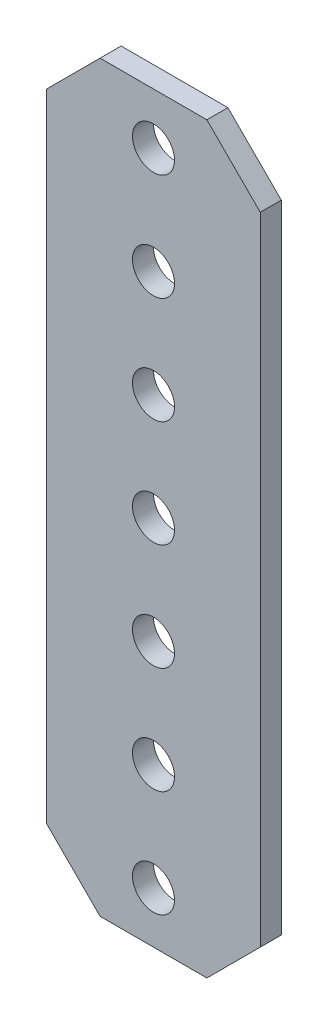
ISO-10303-21;
HEADER;
FILE_DESCRIPTION(('STEP AP214'),'2;1');
FILE_NAME('part.step','',(''),(''),'','','');
FILE_SCHEMA(('AUTOMOTIVE_DESIGN { 1 0 10303 214 1 1 1 1 }'));
ENDSEC;
DATA;
#1=APPLICATION_CONTEXT('core data for automotive mechanical design processes');
#2=APPLICATION_PROTOCOL_DEFINITION('international standard','automotive_design',2000,#1);
#3=PRODUCT_CONTEXT('',#1,'mechanical');
#4=PRODUCT('Part','Part','',(#3));
#5=PRODUCT_RELATED_PRODUCT_CATEGORY('part','',(#4));
#6=PRODUCT_DEFINITION_FORMATION('','',#4);
#7=PRODUCT_DEFINITION_CONTEXT('part definition',#1,'design');
#8=PRODUCT_DEFINITION('design','',#6,#7);
#9=PRODUCT_DEFINITION_SHAPE('','',#8);
#10=(LENGTH_UNIT() NAMED_UNIT(*) SI_UNIT(.MILLI.,.METRE.));
#11=(NAMED_UNIT(*) PLANE_ANGLE_UNIT() SI_UNIT($,.RADIAN.));
#12=(NAMED_UNIT(*) SI_UNIT($,.STERADIAN.) SOLID_ANGLE_UNIT());
#13=UNCERTAINTY_MEASURE_WITH_UNIT(LENGTH_MEASURE(1.E-05),#10,'distance_accuracy_value','');
#14=(GEOMETRIC_REPRESENTATION_CONTEXT(3) GLOBAL_UNCERTAINTY_ASSIGNED_CONTEXT((#13)) GLOBAL_UNIT_ASSIGNED_CONTEXT((#10,
#11,#12)) REPRESENTATION_CONTEXT('',''));
#15=CARTESIAN_POINT('',(0.,0.,0.));
#16=DIRECTION('',(0.,0.,1.));
#17=DIRECTION('',(1.,0.,0.));
#18=AXIS2_PLACEMENT_3D('',#15,#16,#17);
#19=CARTESIAN_POINT('',(-6.34999999999999,44.196,-1.25));
#20=DIRECTION('',(-0.707106781186547,0.707106781186548,0.));
#21=DIRECTION('',(-0.707106781186548,-0.707106781186547,0.));
#22=AXIS2_PLACEMENT_3D('',#19,#20,#21);
#23=PLANE('',#22);
#24=DIRECTION('',(-0.707106781186549,-0.707106781186547,0.));
#25=VECTOR('',#24,1.);
#26=CARTESIAN_POINT('',(-6.34999999999999,44.196,1.25));
#27=LINE('',#26,#25);
#28=CARTESIAN_POINT('',(-6.34999999999999,44.196,1.25));
#29=VERTEX_POINT('',#28);
#30=CARTESIAN_POINT('',(-12.7,37.846,1.25));
#31=VERTEX_POINT('',#30);
#32=EDGE_CURVE('E136',#29,#31,#27,.T.);
#33=ORIENTED_EDGE('',*,*,#32,.F.);
#34=DIRECTION('',(0.,0.,1.));
#35=VECTOR('',#34,1.);
#36=CARTESIAN_POINT('',(-6.34999999999999,44.196,-1.25));
#37=LINE('',#36,#35);
#38=CARTESIAN_POINT('',(-6.34999999999999,44.196,-1.25));
#39=VERTEX_POINT('',#38);
#40=EDGE_CURVE('E11',#39,#29,#37,.T.);
#41=ORIENTED_EDGE('',*,*,#40,.F.);
#42=DIRECTION('',(-0.707106781186549,-0.707106781186547,0.));
#43=VECTOR('',#42,1.);
#44=CARTESIAN_POINT('',(-6.34999999999999,44.196,-1.25));
#45=LINE('',#44,#43);
#46=CARTESIAN_POINT('',(-12.7,37.846,-1.25));
#47=VERTEX_POINT('',#46);
#48=EDGE_CURVE('E157',#39,#47,#45,.T.);
#49=ORIENTED_EDGE('',*,*,#48,.T.);
#50=DIRECTION('',(0.,0.,1.));
#51=VECTOR('',#50,1.);
#52=CARTESIAN_POINT('',(-12.7,37.846,-1.25));
#53=LINE('',#52,#51);
#54=EDGE_CURVE('E42',#47,#31,#53,.T.);
#55=ORIENTED_EDGE('',*,*,#54,.T.);
#56=EDGE_LOOP('',(#33,#41,#49,#55));
#57=FACE_BOUND('',#56,.T.);
#58=ADVANCED_FACE('F39',(#57),#23,.T.);
#59=CARTESIAN_POINT('',(6.35000000000001,44.196,-1.25));
#60=DIRECTION('',(0.,1.,0.));
#61=DIRECTION('',(-1.,0.,0.));
#62=AXIS2_PLACEMENT_3D('',#59,#60,#61);
#63=PLANE('',#62);
#64=DIRECTION('',(-1.,0.,0.));
#65=VECTOR('',#64,1.);
#66=CARTESIAN_POINT('',(6.35000000000001,44.196,1.25));
#67=LINE('',#66,#65);
#68=CARTESIAN_POINT('',(6.35000000000001,44.196,1.25));
#69=VERTEX_POINT('',#68);
#70=EDGE_CURVE('E155',#69,#29,#67,.T.);
#71=ORIENTED_EDGE('',*,*,#70,.F.);
#72=DIRECTION('',(0.,0.,1.));
#73=VECTOR('',#72,1.);
#74=CARTESIAN_POINT('',(6.35000000000001,44.196,-1.25));
#75=LINE('',#74,#73);
#76=CARTESIAN_POINT('',(6.35000000000001,44.196,-1.25));
#77=VERTEX_POINT('',#76);
#78=EDGE_CURVE('E48',#77,#69,#75,.T.);
#79=ORIENTED_EDGE('',*,*,#78,.F.);
#80=DIRECTION('',(-1.,0.,0.));
#81=VECTOR('',#80,1.);
#82=CARTESIAN_POINT('',(6.35000000000001,44.196,-1.25));
#83=LINE('',#82,#81);
#84=EDGE_CURVE('E126',#77,#39,#83,.T.);
#85=ORIENTED_EDGE('',*,*,#84,.T.);
#86=ORIENTED_EDGE('',*,*,#40,.T.);
#87=EDGE_LOOP('',(#71,#79,#85,#86));
#88=FACE_BOUND('',#87,.T.);
#89=ADVANCED_FACE('F169',(#88),#63,.T.);
#90=CARTESIAN_POINT('',(12.7,37.846,-1.25));
#91=DIRECTION('',(0.707106781186548,0.707106781186548,0.));
#92=DIRECTION('',(-0.707106781186548,0.707106781186548,0.));
#93=AXIS2_PLACEMENT_3D('',#90,#91,#92);
#94=PLANE('',#93);
#95=DIRECTION('',(-0.707106781186547,0.707106781186547,0.));
#96=VECTOR('',#95,1.);
#97=CARTESIAN_POINT('',(12.7,37.846,1.25));
#98=LINE('',#97,#96);
#99=CARTESIAN_POINT('',(12.7,37.846,1.25));
#100=VERTEX_POINT('',#99);
#101=EDGE_CURVE('E113',#100,#69,#98,.T.);
#102=ORIENTED_EDGE('',*,*,#101,.F.);
#103=DIRECTION('',(0.,0.,1.));
#104=VECTOR('',#103,1.);
#105=CARTESIAN_POINT('',(12.7,37.846,-1.25));
#106=LINE('',#105,#104);
#107=CARTESIAN_POINT('',(12.7,37.846,-1.25));
#108=VERTEX_POINT('',#107);
#109=EDGE_CURVE('E108',#108,#100,#106,.T.);
#110=ORIENTED_EDGE('',*,*,#109,.F.);
#111=DIRECTION('',(-0.707106781186547,0.707106781186547,0.));
#112=VECTOR('',#111,1.);
#113=CARTESIAN_POINT('',(12.7,37.846,-1.25));
#114=LINE('',#113,#112);
#115=EDGE_CURVE('E111',#108,#77,#114,.T.);
#116=ORIENTED_EDGE('',*,*,#115,.T.);
#117=ORIENTED_EDGE('',*,*,#78,.T.);
#118=EDGE_LOOP('',(#102,#110,#116,#117));
#119=FACE_BOUND('',#118,.T.);
#120=ADVANCED_FACE('F110',(#119),#94,.T.);
#121=CARTESIAN_POINT('',(12.7,-37.846,-1.25));
#122=DIRECTION('',(1.,0.,0.));
#123=DIRECTION('',(0.,0.,-1.));
#124=AXIS2_PLACEMENT_3D('',#121,#122,#123);
#125=PLANE('',#124);
#126=DIRECTION('',(0.,1.,0.));
#127=VECTOR('',#126,1.);
#128=CARTESIAN_POINT('',(12.7,-37.846,1.25));
#129=LINE('',#128,#127);
#130=CARTESIAN_POINT('',(12.7,-37.846,1.25));
#131=VERTEX_POINT('',#130);
#132=EDGE_CURVE('E152',#131,#100,#129,.T.);
#133=ORIENTED_EDGE('',*,*,#132,.F.);
#134=DIRECTION('',(0.,0.,1.));
#135=VECTOR('',#134,1.);
#136=CARTESIAN_POINT('',(12.7,-37.846,-1.25));
#137=LINE('',#136,#135);
#138=CARTESIAN_POINT('',(12.7,-37.846,-1.25));
#139=VERTEX_POINT('',#138);
#140=EDGE_CURVE('E118',#139,#131,#137,.T.);
#141=ORIENTED_EDGE('',*,*,#140,.F.);
#142=DIRECTION('',(0.,1.,0.));
#143=VECTOR('',#142,1.);
#144=CARTESIAN_POINT('',(12.7,-37.846,-1.25));
#145=LINE('',#144,#143);
#146=EDGE_CURVE('E124',#139,#108,#145,.T.);
#147=ORIENTED_EDGE('',*,*,#146,.T.);
#148=ORIENTED_EDGE('',*,*,#109,.T.);
#149=EDGE_LOOP('',(#133,#141,#147,#148));
#150=FACE_BOUND('',#149,.T.);
#151=ADVANCED_FACE('F128',(#150),#125,.T.);
#152=CARTESIAN_POINT('',(6.35000000000001,-44.196,-1.25));
#153=DIRECTION('',(0.707106781186547,-0.707106781186548,0.));
#154=DIRECTION('',(0.707106781186548,0.707106781186547,0.));
#155=AXIS2_PLACEMENT_3D('',#152,#153,#154);
#156=PLANE('',#155);
#157=DIRECTION('',(0.707106781186548,0.707106781186547,0.));
#158=VECTOR('',#157,1.);
#159=CARTESIAN_POINT('',(6.35000000000001,-44.196,1.25));
#160=LINE('',#159,#158);
#161=CARTESIAN_POINT('',(6.35000000000001,-44.196,1.25));
#162=VERTEX_POINT('',#161);
#163=EDGE_CURVE('E149',#162,#131,#160,.T.);
#164=ORIENTED_EDGE('',*,*,#163,.F.);
#165=DIRECTION('',(0.,0.,1.));
#166=VECTOR('',#165,1.);
#167=CARTESIAN_POINT('',(6.35000000000001,-44.196,-1.25));
#168=LINE('',#167,#166);
#169=CARTESIAN_POINT('',(6.35000000000001,-44.196,-1.25));
#170=VERTEX_POINT('',#169);
#171=EDGE_CURVE('E161',#170,#162,#168,.T.);
#172=ORIENTED_EDGE('',*,*,#171,.F.);
#173=DIRECTION('',(0.707106781186548,0.707106781186547,0.));
#174=VECTOR('',#173,1.);
#175=CARTESIAN_POINT('',(6.35000000000001,-44.196,-1.25));
#176=LINE('',#175,#174);
#177=EDGE_CURVE('E129',#170,#139,#176,.T.);
#178=ORIENTED_EDGE('',*,*,#177,.T.);
#179=ORIENTED_EDGE('',*,*,#140,.T.);
#180=EDGE_LOOP('',(#164,#172,#178,#179));
#181=FACE_BOUND('',#180,.T.);
#182=ADVANCED_FACE('F182',(#181),#156,.T.);
#183=CARTESIAN_POINT('',(-6.34999999999999,-44.196,-1.25));
#184=DIRECTION('',(0.,-1.,0.));
#185=DIRECTION('',(0.,0.,-1.));
#186=AXIS2_PLACEMENT_3D('',#183,#184,#185);
#187=PLANE('',#186);
#188=DIRECTION('',(1.,0.,0.));
#189=VECTOR('',#188,1.);
#190=CARTESIAN_POINT('',(-6.34999999999999,-44.196,1.25));
#191=LINE('',#190,#189);
#192=CARTESIAN_POINT('',(-6.34999999999999,-44.196,1.25));
#193=VERTEX_POINT('',#192);
#194=EDGE_CURVE('E146',#193,#162,#191,.T.);
#195=ORIENTED_EDGE('',*,*,#194,.F.);
#196=DIRECTION('',(0.,0.,1.));
#197=VECTOR('',#196,1.);
#198=CARTESIAN_POINT('',(-6.34999999999999,-44.196,-1.25));
#199=LINE('',#198,#197);
#200=CARTESIAN_POINT('',(-6.34999999999999,-44.196,-1.25));
#201=VERTEX_POINT('',#200);
#202=EDGE_CURVE('E163',#201,#193,#199,.T.);
#203=ORIENTED_EDGE('',*,*,#202,.F.);
#204=DIRECTION('',(1.,0.,0.));
#205=VECTOR('',#204,1.);
#206=CARTESIAN_POINT('',(-6.34999999999999,-44.196,-1.25));
#207=LINE('',#206,#205);
#208=EDGE_CURVE('E131',#201,#170,#207,.T.);
#209=ORIENTED_EDGE('',*,*,#208,.T.);
#210=ORIENTED_EDGE('',*,*,#171,.T.);
#211=EDGE_LOOP('',(#195,#203,#209,#210));
#212=FACE_BOUND('',#211,.T.);
#213=ADVANCED_FACE('F185',(#212),#187,.T.);
#214=CARTESIAN_POINT('',(-12.7,-37.846,-1.25));
#215=DIRECTION('',(-0.707106781186547,-0.707106781186548,0.));
#216=DIRECTION('',(0.707106781186548,-0.707106781186547,0.));
#217=AXIS2_PLACEMENT_3D('',#214,#215,#216);
#218=PLANE('',#217);
#219=DIRECTION('',(0.707106781186548,-0.707106781186547,0.));
#220=VECTOR('',#219,1.);
#221=CARTESIAN_POINT('',(-12.7,-37.846,1.25));
#222=LINE('',#221,#220);
#223=CARTESIAN_POINT('',(-12.7,-37.846,1.25));
#224=VERTEX_POINT('',#223);
#225=EDGE_CURVE('E143',#224,#193,#222,.T.);
#226=ORIENTED_EDGE('',*,*,#225,.F.);
#227=DIRECTION('',(0.,0.,1.));
#228=VECTOR('',#227,1.);
#229=CARTESIAN_POINT('',(-12.7,-37.846,-1.25));
#230=LINE('',#229,#228);
#231=CARTESIAN_POINT('',(-12.7,-37.846,-1.25));
#232=VERTEX_POINT('',#231);
#233=EDGE_CURVE('E164',#232,#224,#230,.T.);
#234=ORIENTED_EDGE('',*,*,#233,.F.);
#235=DIRECTION('',(0.707106781186548,-0.707106781186547,0.));
#236=VECTOR('',#235,1.);
#237=CARTESIAN_POINT('',(-12.7,-37.846,-1.25));
#238=LINE('',#237,#236);
#239=EDGE_CURVE('E281',#232,#201,#238,.T.);
#240=ORIENTED_EDGE('',*,*,#239,.T.);
#241=ORIENTED_EDGE('',*,*,#202,.T.);
#242=EDGE_LOOP('',(#226,#234,#240,#241));
#243=FACE_BOUND('',#242,.T.);
#244=ADVANCED_FACE('F189',(#243),#218,.T.);
#245=CARTESIAN_POINT('',(-12.7,37.846,-1.25));
#246=DIRECTION('',(-1.,0.,0.));
#247=DIRECTION('',(0.,-1.,0.));
#248=AXIS2_PLACEMENT_3D('',#245,#246,#247);
#249=PLANE('',#248);
#250=DIRECTION('',(0.,-1.,0.));
#251=VECTOR('',#250,1.);
#252=CARTESIAN_POINT('',(-12.7,37.846,1.25));
#253=LINE('',#252,#251);
#254=EDGE_CURVE('E139',#31,#224,#253,.T.);
#255=ORIENTED_EDGE('',*,*,#254,.F.);
#256=ORIENTED_EDGE('',*,*,#54,.F.);
#257=DIRECTION('',(0.,-1.,0.));
#258=VECTOR('',#257,1.);
#259=CARTESIAN_POINT('',(-12.7,37.846,-1.25));
#260=LINE('',#259,#258);
#261=EDGE_CURVE('E279',#47,#232,#260,.T.);
#262=ORIENTED_EDGE('',*,*,#261,.T.);
#263=ORIENTED_EDGE('',*,*,#233,.T.);
#264=EDGE_LOOP('',(#255,#256,#262,#263));
#265=FACE_BOUND('',#264,.T.);
#266=ADVANCED_FACE('F166',(#265),#249,.T.);
#267=CARTESIAN_POINT('',(0.,0.,-1.25));
#268=DIRECTION('',(0.,0.,1.));
#269=DIRECTION('',(1.,0.,0.));
#270=AXIS2_PLACEMENT_3D('',#267,#268,#269);
#271=PLANE('',#270);
#272=CARTESIAN_POINT('',(0.,25.4,-1.25));
#273=DIRECTION('',(0.,0.,1.));
#274=DIRECTION('',(-1.,0.,0.));
#275=AXIS2_PLACEMENT_3D('',#272,#273,#274);
#276=CIRCLE('',#275,2.5);
#277=CARTESIAN_POINT('',(-2.5,25.4,-1.25));
#278=VERTEX_POINT('',#277);
#279=EDGE_CURVE('E236',#278,#278,#276,.T.);
#280=ORIENTED_EDGE('',*,*,#279,.T.);
#281=EDGE_LOOP('',(#280));
#282=FACE_BOUND('',#281,.T.);
#283=CARTESIAN_POINT('',(0.,38.1,-1.25));
#284=DIRECTION('',(0.,0.,1.));
#285=DIRECTION('',(-1.,0.,0.));
#286=AXIS2_PLACEMENT_3D('',#283,#284,#285);
#287=CIRCLE('',#286,2.5);
#288=CARTESIAN_POINT('',(-2.5,38.1,-1.25));
#289=VERTEX_POINT('',#288);
#290=EDGE_CURVE('E244',#289,#289,#287,.T.);
#291=ORIENTED_EDGE('',*,*,#290,.T.);
#292=EDGE_LOOP('',(#291));
#293=FACE_BOUND('',#292,.T.);
#294=CARTESIAN_POINT('',(0.,12.7,-1.25));
#295=DIRECTION('',(0.,0.,1.));
#296=DIRECTION('',(-1.,0.,0.));
#297=AXIS2_PLACEMENT_3D('',#294,#295,#296);
#298=CIRCLE('',#297,2.5);
#299=CARTESIAN_POINT('',(-2.5,12.7,-1.25));
#300=VERTEX_POINT('',#299);
#301=EDGE_CURVE('E250',#300,#300,#298,.T.);
#302=ORIENTED_EDGE('',*,*,#301,.T.);
#303=EDGE_LOOP('',(#302));
#304=FACE_BOUND('',#303,.T.);
#305=CARTESIAN_POINT('',(0.,0.,-1.25));
#306=DIRECTION('',(0.,0.,1.));
#307=DIRECTION('',(-1.,0.,0.));
#308=AXIS2_PLACEMENT_3D('',#305,#306,#307);
#309=CIRCLE('',#308,2.5);
#310=CARTESIAN_POINT('',(-2.5,0.,-1.25));
#311=VERTEX_POINT('',#310);
#312=EDGE_CURVE('E256',#311,#311,#309,.T.);
#313=ORIENTED_EDGE('',*,*,#312,.T.);
#314=EDGE_LOOP('',(#313));
#315=FACE_BOUND('',#314,.T.);
#316=CARTESIAN_POINT('',(0.,-12.7,-1.25));
#317=DIRECTION('',(0.,0.,1.));
#318=DIRECTION('',(-1.,0.,0.));
#319=AXIS2_PLACEMENT_3D('',#316,#317,#318);
#320=CIRCLE('',#319,2.5);
#321=CARTESIAN_POINT('',(-2.5,-12.7,-1.25));
#322=VERTEX_POINT('',#321);
#323=EDGE_CURVE('E262',#322,#322,#320,.T.);
#324=ORIENTED_EDGE('',*,*,#323,.T.);
#325=EDGE_LOOP('',(#324));
#326=FACE_BOUND('',#325,.T.);
#327=CARTESIAN_POINT('',(0.,-25.4,-1.25));
#328=DIRECTION('',(0.,0.,1.));
#329=DIRECTION('',(-1.,0.,0.));
#330=AXIS2_PLACEMENT_3D('',#327,#328,#329);
#331=CIRCLE('',#330,2.5);
#332=CARTESIAN_POINT('',(-2.5,-25.4,-1.25));
#333=VERTEX_POINT('',#332);
#334=EDGE_CURVE('E268',#333,#333,#331,.T.);
#335=ORIENTED_EDGE('',*,*,#334,.T.);
#336=EDGE_LOOP('',(#335));
#337=FACE_BOUND('',#336,.T.);
#338=CARTESIAN_POINT('',(0.,-38.1,-1.25));
#339=DIRECTION('',(0.,0.,1.));
#340=DIRECTION('',(-1.,0.,0.));
#341=AXIS2_PLACEMENT_3D('',#338,#339,#340);
#342=CIRCLE('',#341,2.5);
#343=CARTESIAN_POINT('',(-2.5,-38.1,-1.25));
#344=VERTEX_POINT('',#343);
#345=EDGE_CURVE('E140',#344,#344,#342,.T.);
#346=ORIENTED_EDGE('',*,*,#345,.T.);
#347=EDGE_LOOP('',(#346));
#348=FACE_BOUND('',#347,.T.);
#349=ORIENTED_EDGE('',*,*,#48,.F.);
#350=ORIENTED_EDGE('',*,*,#84,.F.);
#351=ORIENTED_EDGE('',*,*,#115,.F.);
#352=ORIENTED_EDGE('',*,*,#146,.F.);
#353=ORIENTED_EDGE('',*,*,#177,.F.);
#354=ORIENTED_EDGE('',*,*,#208,.F.);
#355=ORIENTED_EDGE('',*,*,#239,.F.);
#356=ORIENTED_EDGE('',*,*,#261,.F.);
#357=EDGE_LOOP('',(#349,#350,#351,#352,#353,#354,#355,#356));
#358=FACE_BOUND('',#357,.T.);
#359=ADVANCED_FACE('F122',(#282,#293,#304,#315,#326,#337,#348,#358),#271,.F.);
#360=CARTESIAN_POINT('',(0.,0.,1.25));
#361=DIRECTION('',(0.,0.,1.));
#362=DIRECTION('',(1.,0.,0.));
#363=AXIS2_PLACEMENT_3D('',#360,#361,#362);
#364=PLANE('',#363);
#365=CARTESIAN_POINT('',(0.,25.4,1.25));
#366=DIRECTION('',(0.,0.,1.));
#367=DIRECTION('',(-1.,0.,0.));
#368=AXIS2_PLACEMENT_3D('',#365,#366,#367);
#369=CIRCLE('',#368,2.5);
#370=CARTESIAN_POINT('',(-2.5,25.4,1.25));
#371=VERTEX_POINT('',#370);
#372=EDGE_CURVE('E239',#371,#371,#369,.T.);
#373=ORIENTED_EDGE('',*,*,#372,.F.);
#374=EDGE_LOOP('',(#373));
#375=FACE_BOUND('',#374,.T.);
#376=CARTESIAN_POINT('',(0.,38.1,1.25));
#377=DIRECTION('',(0.,0.,1.));
#378=DIRECTION('',(-1.,0.,0.));
#379=AXIS2_PLACEMENT_3D('',#376,#377,#378);
#380=CIRCLE('',#379,2.5);
#381=CARTESIAN_POINT('',(-2.5,38.1,1.25));
#382=VERTEX_POINT('',#381);
#383=EDGE_CURVE('E241',#382,#382,#380,.T.);
#384=ORIENTED_EDGE('',*,*,#383,.F.);
#385=EDGE_LOOP('',(#384));
#386=FACE_BOUND('',#385,.T.);
#387=CARTESIAN_POINT('',(0.,12.7,1.25));
#388=DIRECTION('',(0.,0.,1.));
#389=DIRECTION('',(-1.,0.,0.));
#390=AXIS2_PLACEMENT_3D('',#387,#388,#389);
#391=CIRCLE('',#390,2.5);
#392=CARTESIAN_POINT('',(-2.5,12.7,1.25));
#393=VERTEX_POINT('',#392);
#394=EDGE_CURVE('E247',#393,#393,#391,.T.);
#395=ORIENTED_EDGE('',*,*,#394,.F.);
#396=EDGE_LOOP('',(#395));
#397=FACE_BOUND('',#396,.T.);
#398=CARTESIAN_POINT('',(0.,0.,1.25));
#399=DIRECTION('',(0.,0.,1.));
#400=DIRECTION('',(-1.,0.,0.));
#401=AXIS2_PLACEMENT_3D('',#398,#399,#400);
#402=CIRCLE('',#401,2.5);
#403=CARTESIAN_POINT('',(-2.5,0.,1.25));
#404=VERTEX_POINT('',#403);
#405=EDGE_CURVE('E253',#404,#404,#402,.T.);
#406=ORIENTED_EDGE('',*,*,#405,.F.);
#407=EDGE_LOOP('',(#406));
#408=FACE_BOUND('',#407,.T.);
#409=CARTESIAN_POINT('',(0.,-12.7,1.25));
#410=DIRECTION('',(0.,0.,1.));
#411=DIRECTION('',(-1.,0.,0.));
#412=AXIS2_PLACEMENT_3D('',#409,#410,#411);
#413=CIRCLE('',#412,2.5);
#414=CARTESIAN_POINT('',(-2.5,-12.7,1.25));
#415=VERTEX_POINT('',#414);
#416=EDGE_CURVE('E259',#415,#415,#413,.T.);
#417=ORIENTED_EDGE('',*,*,#416,.F.);
#418=EDGE_LOOP('',(#417));
#419=FACE_BOUND('',#418,.T.);
#420=CARTESIAN_POINT('',(0.,-25.4,1.25));
#421=DIRECTION('',(0.,0.,1.));
#422=DIRECTION('',(-1.,0.,0.));
#423=AXIS2_PLACEMENT_3D('',#420,#421,#422);
#424=CIRCLE('',#423,2.5);
#425=CARTESIAN_POINT('',(-2.5,-25.4,1.25));
#426=VERTEX_POINT('',#425);
#427=EDGE_CURVE('E265',#426,#426,#424,.T.);
#428=ORIENTED_EDGE('',*,*,#427,.F.);
#429=EDGE_LOOP('',(#428));
#430=FACE_BOUND('',#429,.T.);
#431=CARTESIAN_POINT('',(0.,-38.1,1.25));
#432=DIRECTION('',(0.,0.,1.));
#433=DIRECTION('',(-1.,0.,0.));
#434=AXIS2_PLACEMENT_3D('',#431,#432,#433);
#435=CIRCLE('',#434,2.5);
#436=CARTESIAN_POINT('',(-2.5,-38.1,1.25));
#437=VERTEX_POINT('',#436);
#438=EDGE_CURVE('E271',#437,#437,#435,.T.);
#439=ORIENTED_EDGE('',*,*,#438,.F.);
#440=EDGE_LOOP('',(#439));
#441=FACE_BOUND('',#440,.T.);
#442=ORIENTED_EDGE('',*,*,#32,.T.);
#443=ORIENTED_EDGE('',*,*,#254,.T.);
#444=ORIENTED_EDGE('',*,*,#225,.T.);
#445=ORIENTED_EDGE('',*,*,#194,.T.);
#446=ORIENTED_EDGE('',*,*,#163,.T.);
#447=ORIENTED_EDGE('',*,*,#132,.T.);
#448=ORIENTED_EDGE('',*,*,#101,.T.);
#449=ORIENTED_EDGE('',*,*,#70,.T.);
#450=EDGE_LOOP('',(#442,#443,#444,#445,#446,#447,#448,#449));
#451=FACE_BOUND('',#450,.T.);
#452=ADVANCED_FACE('F168',(#375,#386,#397,#408,#419,#430,#441,#451),#364,.T.);
#453=CARTESIAN_POINT('',(0.,-38.1,-1.25));
#454=DIRECTION('',(0.,0.,1.));
#455=DIRECTION('',(1.,0.,0.));
#456=AXIS2_PLACEMENT_3D('',#453,#454,#455);
#457=CYLINDRICAL_SURFACE('',#456,2.5);
#458=ORIENTED_EDGE('',*,*,#345,.F.);
#459=EDGE_LOOP('',(#458));
#460=FACE_BOUND('',#459,.T.);
#461=ORIENTED_EDGE('',*,*,#438,.T.);
#462=EDGE_LOOP('',(#461));
#463=FACE_BOUND('',#462,.T.);
#464=ADVANCED_FACE('F201',(#460,#463),#457,.F.);
#465=CARTESIAN_POINT('',(0.,-25.4,-1.25));
#466=DIRECTION('',(0.,0.,1.));
#467=DIRECTION('',(1.,0.,0.));
#468=AXIS2_PLACEMENT_3D('',#465,#466,#467);
#469=CYLINDRICAL_SURFACE('',#468,2.5);
#470=ORIENTED_EDGE('',*,*,#334,.F.);
#471=EDGE_LOOP('',(#470));
#472=FACE_BOUND('',#471,.T.);
#473=ORIENTED_EDGE('',*,*,#427,.T.);
#474=EDGE_LOOP('',(#473));
#475=FACE_BOUND('',#474,.T.);
#476=ADVANCED_FACE('F208',(#472,#475),#469,.F.);
#477=CARTESIAN_POINT('',(0.,-12.7,-1.25));
#478=DIRECTION('',(0.,0.,1.));
#479=DIRECTION('',(1.,0.,0.));
#480=AXIS2_PLACEMENT_3D('',#477,#478,#479);
#481=CYLINDRICAL_SURFACE('',#480,2.5);
#482=ORIENTED_EDGE('',*,*,#323,.F.);
#483=EDGE_LOOP('',(#482));
#484=FACE_BOUND('',#483,.T.);
#485=ORIENTED_EDGE('',*,*,#416,.T.);
#486=EDGE_LOOP('',(#485));
#487=FACE_BOUND('',#486,.T.);
#488=ADVANCED_FACE('F212',(#484,#487),#481,.F.);
#489=CARTESIAN_POINT('',(0.,0.,-1.25));
#490=DIRECTION('',(0.,0.,1.));
#491=DIRECTION('',(1.,0.,0.));
#492=AXIS2_PLACEMENT_3D('',#489,#490,#491);
#493=CYLINDRICAL_SURFACE('',#492,2.5);
#494=ORIENTED_EDGE('',*,*,#312,.F.);
#495=EDGE_LOOP('',(#494));
#496=FACE_BOUND('',#495,.T.);
#497=ORIENTED_EDGE('',*,*,#405,.T.);
#498=EDGE_LOOP('',(#497));
#499=FACE_BOUND('',#498,.T.);
#500=ADVANCED_FACE('F216',(#496,#499),#493,.F.);
#501=CARTESIAN_POINT('',(0.,12.7,-1.25));
#502=DIRECTION('',(0.,0.,1.));
#503=DIRECTION('',(1.,0.,0.));
#504=AXIS2_PLACEMENT_3D('',#501,#502,#503);
#505=CYLINDRICAL_SURFACE('',#504,2.5);
#506=ORIENTED_EDGE('',*,*,#301,.F.);
#507=EDGE_LOOP('',(#506));
#508=FACE_BOUND('',#507,.T.);
#509=ORIENTED_EDGE('',*,*,#394,.T.);
#510=EDGE_LOOP('',(#509));
#511=FACE_BOUND('',#510,.T.);
#512=ADVANCED_FACE('F220',(#508,#511),#505,.F.);
#513=CARTESIAN_POINT('',(0.,38.1,-1.25));
#514=DIRECTION('',(0.,0.,1.));
#515=DIRECTION('',(1.,0.,0.));
#516=AXIS2_PLACEMENT_3D('',#513,#514,#515);
#517=CYLINDRICAL_SURFACE('',#516,2.5);
#518=ORIENTED_EDGE('',*,*,#290,.F.);
#519=EDGE_LOOP('',(#518));
#520=FACE_BOUND('',#519,.T.);
#521=ORIENTED_EDGE('',*,*,#383,.T.);
#522=EDGE_LOOP('',(#521));
#523=FACE_BOUND('',#522,.T.);
#524=ADVANCED_FACE('F224',(#520,#523),#517,.F.);
#525=CARTESIAN_POINT('',(0.,25.4,-1.25));
#526=DIRECTION('',(0.,0.,1.));
#527=DIRECTION('',(1.,0.,0.));
#528=AXIS2_PLACEMENT_3D('',#525,#526,#527);
#529=CYLINDRICAL_SURFACE('',#528,2.5);
#530=ORIENTED_EDGE('',*,*,#279,.F.);
#531=EDGE_LOOP('',(#530));
#532=FACE_BOUND('',#531,.T.);
#533=ORIENTED_EDGE('',*,*,#372,.T.);
#534=EDGE_LOOP('',(#533));
#535=FACE_BOUND('',#534,.T.);
#536=ADVANCED_FACE('F228',(#532,#535),#529,.F.);
#537=CLOSED_SHELL('',(#58,#89,#120,#151,#182,#213,#244,#266,#359,#452,#464,#476,#488,#500,#512,
#524,#536));
#538=MANIFOLD_SOLID_BREP('B2',#537);
#539=ADVANCED_BREP_SHAPE_REPRESENTATION('',(#18,#538),#14);
#540=SHAPE_DEFINITION_REPRESENTATION(#9,#539);
ENDSEC;
END-ISO-10303-21;
